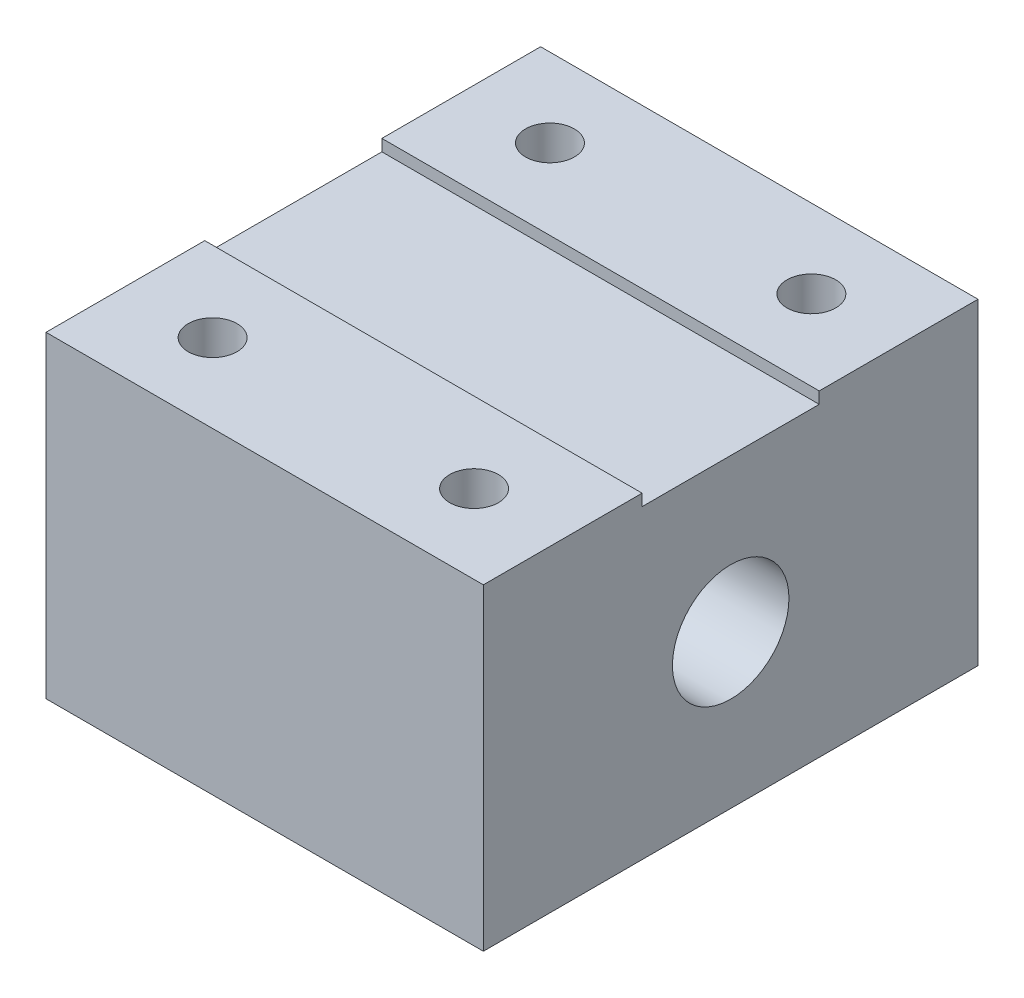
ISO-10303-21;
HEADER;
FILE_DESCRIPTION(('STEP AP214'),'2;1');
FILE_NAME('part.step','',(''),(''),'','','');
FILE_SCHEMA(('AUTOMOTIVE_DESIGN { 1 0 10303 214 1 1 1 1 }'));
ENDSEC;
DATA;
#1=APPLICATION_CONTEXT('core data for automotive mechanical design processes');
#2=APPLICATION_PROTOCOL_DEFINITION('international standard','automotive_design',2000,#1);
#3=PRODUCT_CONTEXT('',#1,'mechanical');
#4=PRODUCT('Part','Part','',(#3));
#5=PRODUCT_RELATED_PRODUCT_CATEGORY('part','',(#4));
#6=PRODUCT_DEFINITION_FORMATION('','',#4);
#7=PRODUCT_DEFINITION_CONTEXT('part definition',#1,'design');
#8=PRODUCT_DEFINITION('design','',#6,#7);
#9=PRODUCT_DEFINITION_SHAPE('','',#8);
#10=(LENGTH_UNIT() NAMED_UNIT(*) SI_UNIT(.MILLI.,.METRE.));
#11=(NAMED_UNIT(*) PLANE_ANGLE_UNIT() SI_UNIT($,.RADIAN.));
#12=(NAMED_UNIT(*) SI_UNIT($,.STERADIAN.) SOLID_ANGLE_UNIT());
#13=UNCERTAINTY_MEASURE_WITH_UNIT(LENGTH_MEASURE(1.E-05),#10,'distance_accuracy_value','');
#14=(GEOMETRIC_REPRESENTATION_CONTEXT(3) GLOBAL_UNCERTAINTY_ASSIGNED_CONTEXT((#13)) GLOBAL_UNIT_ASSIGNED_CONTEXT((#10,
#11,#12)) REPRESENTATION_CONTEXT('',''));
#15=CARTESIAN_POINT('',(0.,0.,0.));
#16=DIRECTION('',(0.,0.,1.));
#17=DIRECTION('',(1.,0.,0.));
#18=AXIS2_PLACEMENT_3D('',#15,#16,#17);
#19=CARTESIAN_POINT('',(0.,21.79,0.));
#20=DIRECTION('',(0.,-1.,0.));
#21=DIRECTION('',(0.,0.,-1.));
#22=AXIS2_PLACEMENT_3D('',#19,#20,#21);
#23=PLANE('',#22);
#24=CARTESIAN_POINT('',(6.04,21.79,-28.56));
#25=DIRECTION('',(0.,1.,0.));
#26=DIRECTION('',(0.,0.,-1.));
#27=AXIS2_PLACEMENT_3D('',#24,#25,#26);
#28=CIRCLE('',#27,1.675);
#29=CARTESIAN_POINT('',(6.04,21.79,-30.235));
#30=VERTEX_POINT('',#29);
#31=EDGE_CURVE('E151',#30,#30,#28,.T.);
#32=ORIENTED_EDGE('',*,*,#31,.F.);
#33=EDGE_LOOP('',(#32));
#34=FACE_BOUND('',#33,.T.);
#35=CARTESIAN_POINT('',(23.99,21.79,-28.56));
#36=DIRECTION('',(0.,1.,0.));
#37=DIRECTION('',(0.,0.,1.));
#38=AXIS2_PLACEMENT_3D('',#35,#36,#37);
#39=CIRCLE('',#38,1.675);
#40=CARTESIAN_POINT('',(23.99,21.79,-26.885));
#41=VERTEX_POINT('',#40);
#42=EDGE_CURVE('E157',#41,#41,#39,.T.);
#43=ORIENTED_EDGE('',*,*,#42,.F.);
#44=EDGE_LOOP('',(#43));
#45=FACE_BOUND('',#44,.T.);
#46=DIRECTION('',(0.,0.,1.));
#47=VECTOR('',#46,1.);
#48=CARTESIAN_POINT('',(0.,21.79,0.));
#49=LINE('',#48,#47);
#50=CARTESIAN_POINT('',(0.,21.79,-33.96));
#51=VERTEX_POINT('',#50);
#52=CARTESIAN_POINT('',(0.,21.79,-23.06));
#53=VERTEX_POINT('',#52);
#54=EDGE_CURVE('E163',#51,#53,#49,.T.);
#55=ORIENTED_EDGE('',*,*,#54,.T.);
#56=DIRECTION('',(-1.,0.,0.));
#57=VECTOR('',#56,1.);
#58=CARTESIAN_POINT('',(0.,21.79,-23.06));
#59=LINE('',#58,#57);
#60=CARTESIAN_POINT('',(30.03,21.79,-23.06));
#61=VERTEX_POINT('',#60);
#62=EDGE_CURVE('E122',#61,#53,#59,.T.);
#63=ORIENTED_EDGE('',*,*,#62,.F.);
#64=DIRECTION('',(0.,0.,-1.));
#65=VECTOR('',#64,1.);
#66=CARTESIAN_POINT('',(30.03,21.79,0.));
#67=LINE('',#66,#65);
#68=CARTESIAN_POINT('',(30.03,21.79,-33.96));
#69=VERTEX_POINT('',#68);
#70=EDGE_CURVE('E167',#61,#69,#67,.T.);
#71=ORIENTED_EDGE('',*,*,#70,.T.);
#72=DIRECTION('',(-1.,0.,0.));
#73=VECTOR('',#72,1.);
#74=CARTESIAN_POINT('',(0.,21.79,-33.96));
#75=LINE('',#74,#73);
#76=EDGE_CURVE('E56',#69,#51,#75,.T.);
#77=ORIENTED_EDGE('',*,*,#76,.T.);
#78=EDGE_LOOP('',(#55,#63,#71,#77));
#79=FACE_BOUND('',#78,.T.);
#80=ADVANCED_FACE('F32',(#34,#45,#79),#23,.F.);
#81=CARTESIAN_POINT('',(30.03,21.79,0.));
#82=VERTEX_POINT('',#81);
#83=CARTESIAN_POINT('',(30.03,21.79,-10.9));
#84=VERTEX_POINT('',#83);
#85=EDGE_CURVE('E168',#82,#84,#67,.T.);
#86=ORIENTED_EDGE('',*,*,#85,.T.);
#87=DIRECTION('',(1.,0.,0.));
#88=VECTOR('',#87,1.);
#89=CARTESIAN_POINT('',(0.,21.79,-10.9));
#90=LINE('',#89,#88);
#91=CARTESIAN_POINT('',(0.,21.79,-10.9));
#92=VERTEX_POINT('',#91);
#93=EDGE_CURVE('E201',#92,#84,#90,.T.);
#94=ORIENTED_EDGE('',*,*,#93,.F.);
#95=CARTESIAN_POINT('',(0.,21.79,0.));
#96=VERTEX_POINT('',#95);
#97=EDGE_CURVE('E85',#92,#96,#49,.T.);
#98=ORIENTED_EDGE('',*,*,#97,.T.);
#99=DIRECTION('',(1.,0.,0.));
#100=VECTOR('',#99,1.);
#101=CARTESIAN_POINT('',(0.,21.79,0.));
#102=LINE('',#101,#100);
#103=EDGE_CURVE('E165',#96,#82,#102,.T.);
#104=ORIENTED_EDGE('',*,*,#103,.T.);
#105=EDGE_LOOP('',(#86,#94,#98,#104));
#106=FACE_BOUND('',#105,.T.);
#107=CARTESIAN_POINT('',(23.99,21.79,-5.4));
#108=DIRECTION('',(0.,1.,0.));
#109=DIRECTION('',(0.,0.,-1.));
#110=AXIS2_PLACEMENT_3D('',#107,#108,#109);
#111=CIRCLE('',#110,1.675);
#112=CARTESIAN_POINT('',(23.99,21.79,-7.075));
#113=VERTEX_POINT('',#112);
#114=EDGE_CURVE('E145',#113,#113,#111,.T.);
#115=ORIENTED_EDGE('',*,*,#114,.F.);
#116=EDGE_LOOP('',(#115));
#117=FACE_BOUND('',#116,.T.);
#118=CARTESIAN_POINT('',(6.04,21.79,-5.4));
#119=DIRECTION('',(0.,1.,0.));
#120=DIRECTION('',(0.,0.,1.));
#121=AXIS2_PLACEMENT_3D('',#118,#119,#120);
#122=CIRCLE('',#121,1.675);
#123=CARTESIAN_POINT('',(6.04,21.79,-3.725));
#124=VERTEX_POINT('',#123);
#125=EDGE_CURVE('E139',#124,#124,#122,.T.);
#126=ORIENTED_EDGE('',*,*,#125,.F.);
#127=EDGE_LOOP('',(#126));
#128=FACE_BOUND('',#127,.T.);
#129=ADVANCED_FACE('F219',(#106,#117,#128),#23,.F.);
#130=CARTESIAN_POINT('',(0.,0.,0.));
#131=DIRECTION('',(0.,-1.,0.));
#132=DIRECTION('',(0.,0.,-1.));
#133=AXIS2_PLACEMENT_3D('',#130,#131,#132);
#134=PLANE('',#133);
#135=CARTESIAN_POINT('',(23.99,0.,-5.4));
#136=DIRECTION('',(0.,1.,0.));
#137=DIRECTION('',(0.,0.,-1.));
#138=AXIS2_PLACEMENT_3D('',#135,#136,#137);
#139=CIRCLE('',#138,1.675);
#140=CARTESIAN_POINT('',(23.99,0.,-7.075));
#141=VERTEX_POINT('',#140);
#142=EDGE_CURVE('E142',#141,#141,#139,.T.);
#143=ORIENTED_EDGE('',*,*,#142,.T.);
#144=EDGE_LOOP('',(#143));
#145=FACE_BOUND('',#144,.T.);
#146=CARTESIAN_POINT('',(23.99,0.,-28.56));
#147=DIRECTION('',(0.,1.,0.));
#148=DIRECTION('',(0.,0.,1.));
#149=AXIS2_PLACEMENT_3D('',#146,#147,#148);
#150=CIRCLE('',#149,1.675);
#151=CARTESIAN_POINT('',(23.99,0.,-26.885));
#152=VERTEX_POINT('',#151);
#153=EDGE_CURVE('E154',#152,#152,#150,.T.);
#154=ORIENTED_EDGE('',*,*,#153,.T.);
#155=EDGE_LOOP('',(#154));
#156=FACE_BOUND('',#155,.T.);
#157=DIRECTION('',(0.,0.,1.));
#158=VECTOR('',#157,1.);
#159=CARTESIAN_POINT('',(0.,0.,0.));
#160=LINE('',#159,#158);
#161=CARTESIAN_POINT('',(0.,0.,-33.96));
#162=VERTEX_POINT('',#161);
#163=CARTESIAN_POINT('',(0.,0.,0.));
#164=VERTEX_POINT('',#163);
#165=EDGE_CURVE('E160',#162,#164,#160,.T.);
#166=ORIENTED_EDGE('',*,*,#165,.F.);
#167=DIRECTION('',(-1.,0.,0.));
#168=VECTOR('',#167,1.);
#169=CARTESIAN_POINT('',(0.,0.,-33.96));
#170=LINE('',#169,#168);
#171=CARTESIAN_POINT('',(30.03,0.,-33.96));
#172=VERTEX_POINT('',#171);
#173=EDGE_CURVE('E77',#172,#162,#170,.T.);
#174=ORIENTED_EDGE('',*,*,#173,.F.);
#175=DIRECTION('',(0.,0.,-1.));
#176=VECTOR('',#175,1.);
#177=CARTESIAN_POINT('',(30.03,0.,0.));
#178=LINE('',#177,#176);
#179=CARTESIAN_POINT('',(30.03,0.,0.));
#180=VERTEX_POINT('',#179);
#181=EDGE_CURVE('E177',#180,#172,#178,.T.);
#182=ORIENTED_EDGE('',*,*,#181,.F.);
#183=DIRECTION('',(1.,0.,0.));
#184=VECTOR('',#183,1.);
#185=CARTESIAN_POINT('',(0.,0.,0.));
#186=LINE('',#185,#184);
#187=EDGE_CURVE('E175',#164,#180,#186,.T.);
#188=ORIENTED_EDGE('',*,*,#187,.F.);
#189=EDGE_LOOP('',(#166,#174,#182,#188));
#190=FACE_BOUND('',#189,.T.);
#191=CARTESIAN_POINT('',(6.04,0.,-28.56));
#192=DIRECTION('',(0.,1.,0.));
#193=DIRECTION('',(0.,0.,-1.));
#194=AXIS2_PLACEMENT_3D('',#191,#192,#193);
#195=CIRCLE('',#194,1.675);
#196=CARTESIAN_POINT('',(6.04,0.,-30.235));
#197=VERTEX_POINT('',#196);
#198=EDGE_CURVE('E148',#197,#197,#195,.T.);
#199=ORIENTED_EDGE('',*,*,#198,.T.);
#200=EDGE_LOOP('',(#199));
#201=FACE_BOUND('',#200,.T.);
#202=CARTESIAN_POINT('',(6.04,0.,-5.4));
#203=DIRECTION('',(0.,1.,0.));
#204=DIRECTION('',(0.,0.,1.));
#205=AXIS2_PLACEMENT_3D('',#202,#203,#204);
#206=CIRCLE('',#205,1.675);
#207=CARTESIAN_POINT('',(6.04,0.,-3.725));
#208=VERTEX_POINT('',#207);
#209=EDGE_CURVE('E134',#208,#208,#206,.T.);
#210=ORIENTED_EDGE('',*,*,#209,.T.);
#211=EDGE_LOOP('',(#210));
#212=FACE_BOUND('',#211,.T.);
#213=ADVANCED_FACE('F194',(#145,#156,#190,#201,#212),#134,.T.);
#214=CARTESIAN_POINT('',(0.,21.79,0.));
#215=DIRECTION('',(1.,0.,0.));
#216=DIRECTION('',(0.,0.,-1.));
#217=AXIS2_PLACEMENT_3D('',#214,#215,#216);
#218=PLANE('',#217);
#219=CARTESIAN_POINT('',(0.,10.5,-16.98));
#220=DIRECTION('',(1.,0.,0.));
#221=DIRECTION('',(0.,0.,-1.));
#222=AXIS2_PLACEMENT_3D('',#219,#220,#221);
#223=CIRCLE('',#222,4.);
#224=CARTESIAN_POINT('',(0.,10.5,-20.98));
#225=VERTEX_POINT('',#224);
#226=EDGE_CURVE('E131',#225,#225,#223,.T.);
#227=ORIENTED_EDGE('',*,*,#226,.T.);
#228=EDGE_LOOP('',(#227));
#229=FACE_BOUND('',#228,.T.);
#230=DIRECTION('',(0.,0.,1.));
#231=VECTOR('',#230,1.);
#232=CARTESIAN_POINT('',(0.,20.99,-23.06));
#233=LINE('',#232,#231);
#234=CARTESIAN_POINT('',(0.,20.99,-23.06));
#235=VERTEX_POINT('',#234);
#236=CARTESIAN_POINT('',(0.,20.99,-10.9));
#237=VERTEX_POINT('',#236);
#238=EDGE_CURVE('E113',#235,#237,#233,.T.);
#239=ORIENTED_EDGE('',*,*,#238,.F.);
#240=DIRECTION('',(0.,1.,0.));
#241=VECTOR('',#240,1.);
#242=CARTESIAN_POINT('',(0.,20.99,-23.06));
#243=LINE('',#242,#241);
#244=EDGE_CURVE('E138',#235,#53,#243,.T.);
#245=ORIENTED_EDGE('',*,*,#244,.T.);
#246=ORIENTED_EDGE('',*,*,#54,.F.);
#247=DIRECTION('',(0.,-1.,0.));
#248=VECTOR('',#247,1.);
#249=CARTESIAN_POINT('',(0.,21.79,-33.96));
#250=LINE('',#249,#248);
#251=EDGE_CURVE('E172',#51,#162,#250,.T.);
#252=ORIENTED_EDGE('',*,*,#251,.T.);
#253=ORIENTED_EDGE('',*,*,#165,.T.);
#254=DIRECTION('',(0.,-1.,0.));
#255=VECTOR('',#254,1.);
#256=CARTESIAN_POINT('',(0.,21.79,0.));
#257=LINE('',#256,#255);
#258=EDGE_CURVE('E11',#96,#164,#257,.T.);
#259=ORIENTED_EDGE('',*,*,#258,.F.);
#260=ORIENTED_EDGE('',*,*,#97,.F.);
#261=DIRECTION('',(0.,1.,0.));
#262=VECTOR('',#261,1.);
#263=CARTESIAN_POINT('',(0.,20.99,-10.9));
#264=LINE('',#263,#262);
#265=EDGE_CURVE('E108',#237,#92,#264,.T.);
#266=ORIENTED_EDGE('',*,*,#265,.F.);
#267=EDGE_LOOP('',(#239,#245,#246,#252,#253,#259,#260,#266));
#268=FACE_BOUND('',#267,.T.);
#269=ADVANCED_FACE('F34',(#229,#268),#218,.F.);
#270=CARTESIAN_POINT('',(0.,21.79,0.));
#271=DIRECTION('',(0.,0.,-1.));
#272=DIRECTION('',(-1.,0.,0.));
#273=AXIS2_PLACEMENT_3D('',#270,#271,#272);
#274=PLANE('',#273);
#275=ORIENTED_EDGE('',*,*,#187,.T.);
#276=DIRECTION('',(0.,-1.,0.));
#277=VECTOR('',#276,1.);
#278=CARTESIAN_POINT('',(30.03,21.79,0.));
#279=LINE('',#278,#277);
#280=EDGE_CURVE('E40',#82,#180,#279,.T.);
#281=ORIENTED_EDGE('',*,*,#280,.F.);
#282=ORIENTED_EDGE('',*,*,#103,.F.);
#283=ORIENTED_EDGE('',*,*,#258,.T.);
#284=EDGE_LOOP('',(#275,#281,#282,#283));
#285=FACE_BOUND('',#284,.T.);
#286=ADVANCED_FACE('F237',(#285),#274,.F.);
#287=CARTESIAN_POINT('',(30.03,21.79,0.));
#288=DIRECTION('',(-1.,0.,0.));
#289=DIRECTION('',(0.,0.,1.));
#290=AXIS2_PLACEMENT_3D('',#287,#288,#289);
#291=PLANE('',#290);
#292=ORIENTED_EDGE('',*,*,#70,.F.);
#293=DIRECTION('',(0.,1.,0.));
#294=VECTOR('',#293,1.);
#295=CARTESIAN_POINT('',(30.03,20.99,-23.06));
#296=LINE('',#295,#294);
#297=CARTESIAN_POINT('',(30.03,20.99,-23.06));
#298=VERTEX_POINT('',#297);
#299=EDGE_CURVE('E126',#298,#61,#296,.T.);
#300=ORIENTED_EDGE('',*,*,#299,.F.);
#301=DIRECTION('',(0.,0.,-1.));
#302=VECTOR('',#301,1.);
#303=CARTESIAN_POINT('',(30.03,20.99,-23.06));
#304=LINE('',#303,#302);
#305=CARTESIAN_POINT('',(30.03,20.99,-10.9));
#306=VERTEX_POINT('',#305);
#307=EDGE_CURVE('E112',#306,#298,#304,.T.);
#308=ORIENTED_EDGE('',*,*,#307,.F.);
#309=DIRECTION('',(0.,1.,0.));
#310=VECTOR('',#309,1.);
#311=CARTESIAN_POINT('',(30.03,20.99,-10.9));
#312=LINE('',#311,#310);
#313=EDGE_CURVE('E110',#306,#84,#312,.T.);
#314=ORIENTED_EDGE('',*,*,#313,.T.);
#315=ORIENTED_EDGE('',*,*,#85,.F.);
#316=ORIENTED_EDGE('',*,*,#280,.T.);
#317=ORIENTED_EDGE('',*,*,#181,.T.);
#318=DIRECTION('',(0.,-1.,0.));
#319=VECTOR('',#318,1.);
#320=CARTESIAN_POINT('',(30.03,21.79,-33.96));
#321=LINE('',#320,#319);
#322=EDGE_CURVE('E181',#69,#172,#321,.T.);
#323=ORIENTED_EDGE('',*,*,#322,.F.);
#324=EDGE_LOOP('',(#292,#300,#308,#314,#315,#316,#317,#323));
#325=FACE_BOUND('',#324,.T.);
#326=CARTESIAN_POINT('',(30.03,10.5,-16.98));
#327=DIRECTION('',(1.,0.,0.));
#328=DIRECTION('',(0.,0.,-1.));
#329=AXIS2_PLACEMENT_3D('',#326,#327,#328);
#330=CIRCLE('',#329,4.);
#331=CARTESIAN_POINT('',(30.03,10.5,-20.98));
#332=VERTEX_POINT('',#331);
#333=EDGE_CURVE('E135',#332,#332,#330,.T.);
#334=ORIENTED_EDGE('',*,*,#333,.F.);
#335=EDGE_LOOP('',(#334));
#336=FACE_BOUND('',#335,.T.);
#337=ADVANCED_FACE('F188',(#325,#336),#291,.F.);
#338=CARTESIAN_POINT('',(0.,21.79,-33.96));
#339=DIRECTION('',(0.,0.,1.));
#340=DIRECTION('',(1.,0.,0.));
#341=AXIS2_PLACEMENT_3D('',#338,#339,#340);
#342=PLANE('',#341);
#343=ORIENTED_EDGE('',*,*,#173,.T.);
#344=ORIENTED_EDGE('',*,*,#251,.F.);
#345=ORIENTED_EDGE('',*,*,#76,.F.);
#346=ORIENTED_EDGE('',*,*,#322,.T.);
#347=EDGE_LOOP('',(#343,#344,#345,#346));
#348=FACE_BOUND('',#347,.T.);
#349=ADVANCED_FACE('F197',(#348),#342,.F.);
#350=CARTESIAN_POINT('',(23.99,21.79,-28.56));
#351=DIRECTION('',(0.,-1.,0.));
#352=DIRECTION('',(0.,0.,-1.));
#353=AXIS2_PLACEMENT_3D('',#350,#351,#352);
#354=CYLINDRICAL_SURFACE('',#353,1.675);
#355=ORIENTED_EDGE('',*,*,#42,.T.);
#356=EDGE_LOOP('',(#355));
#357=FACE_BOUND('',#356,.T.);
#358=ORIENTED_EDGE('',*,*,#153,.F.);
#359=EDGE_LOOP('',(#358));
#360=FACE_BOUND('',#359,.T.);
#361=ADVANCED_FACE('F229',(#357,#360),#354,.F.);
#362=CARTESIAN_POINT('',(6.04,21.79,-28.56));
#363=DIRECTION('',(0.,-1.,0.));
#364=DIRECTION('',(0.,0.,-1.));
#365=AXIS2_PLACEMENT_3D('',#362,#363,#364);
#366=CYLINDRICAL_SURFACE('',#365,1.675);
#367=ORIENTED_EDGE('',*,*,#31,.T.);
#368=EDGE_LOOP('',(#367));
#369=FACE_BOUND('',#368,.T.);
#370=ORIENTED_EDGE('',*,*,#198,.F.);
#371=EDGE_LOOP('',(#370));
#372=FACE_BOUND('',#371,.T.);
#373=ADVANCED_FACE('F258',(#369,#372),#366,.F.);
#374=CARTESIAN_POINT('',(23.99,21.79,-5.4));
#375=DIRECTION('',(0.,-1.,0.));
#376=DIRECTION('',(0.,0.,-1.));
#377=AXIS2_PLACEMENT_3D('',#374,#375,#376);
#378=CYLINDRICAL_SURFACE('',#377,1.675);
#379=ORIENTED_EDGE('',*,*,#114,.T.);
#380=EDGE_LOOP('',(#379));
#381=FACE_BOUND('',#380,.T.);
#382=ORIENTED_EDGE('',*,*,#142,.F.);
#383=EDGE_LOOP('',(#382));
#384=FACE_BOUND('',#383,.T.);
#385=ADVANCED_FACE('F251',(#381,#384),#378,.F.);
#386=CARTESIAN_POINT('',(6.04,21.79,-5.4));
#387=DIRECTION('',(0.,-1.,0.));
#388=DIRECTION('',(0.,0.,-1.));
#389=AXIS2_PLACEMENT_3D('',#386,#387,#388);
#390=CYLINDRICAL_SURFACE('',#389,1.675);
#391=ORIENTED_EDGE('',*,*,#125,.T.);
#392=EDGE_LOOP('',(#391));
#393=FACE_BOUND('',#392,.T.);
#394=ORIENTED_EDGE('',*,*,#209,.F.);
#395=EDGE_LOOP('',(#394));
#396=FACE_BOUND('',#395,.T.);
#397=ADVANCED_FACE('F214',(#393,#396),#390,.F.);
#398=CARTESIAN_POINT('',(0.,10.5,-16.98));
#399=DIRECTION('',(1.,0.,0.));
#400=DIRECTION('',(0.,0.,-1.));
#401=AXIS2_PLACEMENT_3D('',#398,#399,#400);
#402=CYLINDRICAL_SURFACE('',#401,4.);
#403=ORIENTED_EDGE('',*,*,#226,.F.);
#404=EDGE_LOOP('',(#403));
#405=FACE_BOUND('',#404,.T.);
#406=ORIENTED_EDGE('',*,*,#333,.T.);
#407=EDGE_LOOP('',(#406));
#408=FACE_BOUND('',#407,.T.);
#409=ADVANCED_FACE('F207',(#405,#408),#402,.F.);
#410=CARTESIAN_POINT('',(0.,20.99,-23.06));
#411=DIRECTION('',(0.,0.,-1.));
#412=DIRECTION('',(-1.,0.,0.));
#413=AXIS2_PLACEMENT_3D('',#410,#411,#412);
#414=PLANE('',#413);
#415=ORIENTED_EDGE('',*,*,#62,.T.);
#416=ORIENTED_EDGE('',*,*,#244,.F.);
#417=DIRECTION('',(-1.,0.,0.));
#418=VECTOR('',#417,1.);
#419=CARTESIAN_POINT('',(0.,20.99,-23.06));
#420=LINE('',#419,#418);
#421=EDGE_CURVE('E119',#298,#235,#420,.T.);
#422=ORIENTED_EDGE('',*,*,#421,.F.);
#423=ORIENTED_EDGE('',*,*,#299,.T.);
#424=EDGE_LOOP('',(#415,#416,#422,#423));
#425=FACE_BOUND('',#424,.T.);
#426=ADVANCED_FACE('F205',(#425),#414,.F.);
#427=CARTESIAN_POINT('',(0.,20.99,-10.9));
#428=DIRECTION('',(0.,0.,1.));
#429=DIRECTION('',(1.,0.,0.));
#430=AXIS2_PLACEMENT_3D('',#427,#428,#429);
#431=PLANE('',#430);
#432=ORIENTED_EDGE('',*,*,#93,.T.);
#433=ORIENTED_EDGE('',*,*,#313,.F.);
#434=DIRECTION('',(1.,0.,0.));
#435=VECTOR('',#434,1.);
#436=CARTESIAN_POINT('',(0.,20.99,-10.9));
#437=LINE('',#436,#435);
#438=EDGE_CURVE('E47',#237,#306,#437,.T.);
#439=ORIENTED_EDGE('',*,*,#438,.F.);
#440=ORIENTED_EDGE('',*,*,#265,.T.);
#441=EDGE_LOOP('',(#432,#433,#439,#440));
#442=FACE_BOUND('',#441,.T.);
#443=ADVANCED_FACE('F106',(#442),#431,.F.);
#444=CARTESIAN_POINT('',(0.,20.99,0.));
#445=DIRECTION('',(0.,1.,0.));
#446=DIRECTION('',(0.,0.,1.));
#447=AXIS2_PLACEMENT_3D('',#444,#445,#446);
#448=PLANE('',#447);
#449=ORIENTED_EDGE('',*,*,#238,.T.);
#450=ORIENTED_EDGE('',*,*,#438,.T.);
#451=ORIENTED_EDGE('',*,*,#307,.T.);
#452=ORIENTED_EDGE('',*,*,#421,.T.);
#453=EDGE_LOOP('',(#449,#450,#451,#452));
#454=FACE_BOUND('',#453,.T.);
#455=ADVANCED_FACE('F117',(#454),#448,.T.);
#456=CLOSED_SHELL('',(#80,#129,#213,#269,#286,#337,#349,#361,#373,#385,#397,#409,#426,#443,#455));
#457=MANIFOLD_SOLID_BREP('B2',#456);
#458=ADVANCED_BREP_SHAPE_REPRESENTATION('',(#18,#457),#14);
#459=SHAPE_DEFINITION_REPRESENTATION(#9,#458);
ENDSEC;
END-ISO-10303-21;
